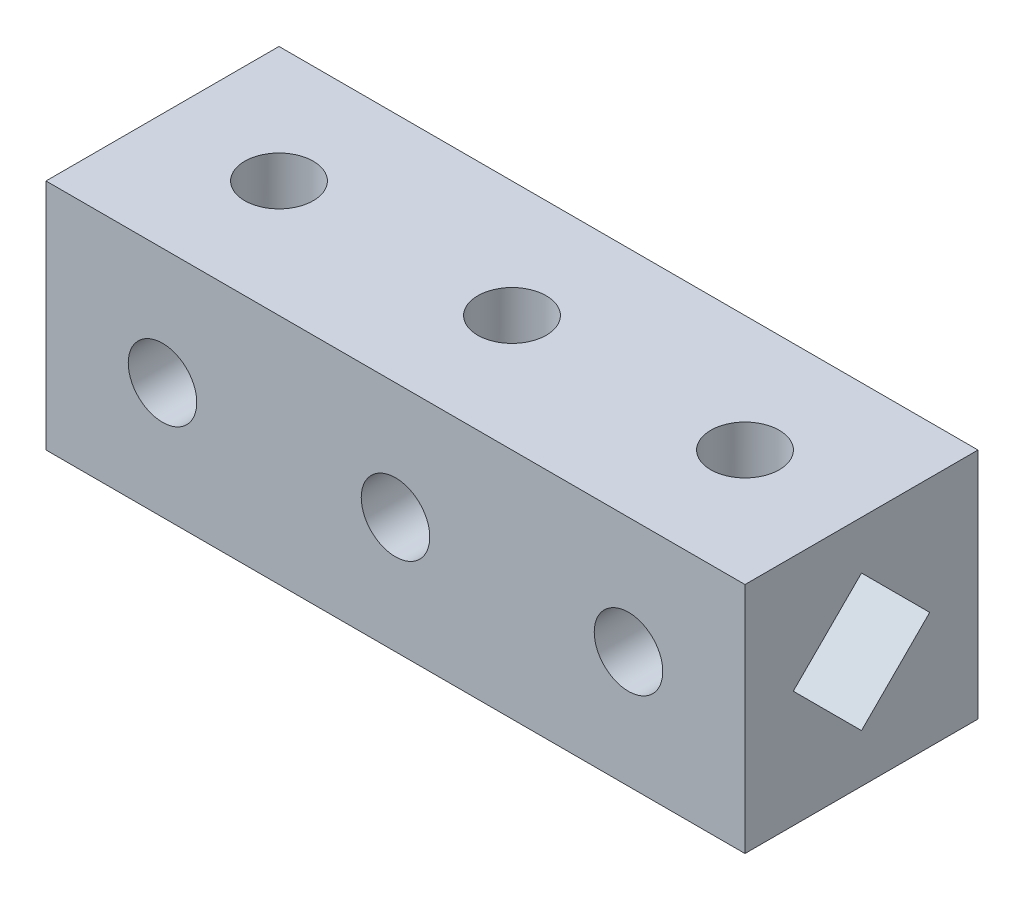
ISO-10303-21;
HEADER;
FILE_DESCRIPTION(('STEP AP214'),'2;1');
FILE_NAME('part.step','',(''),(''),'','','');
FILE_SCHEMA(('AUTOMOTIVE_DESIGN { 1 0 10303 214 1 1 1 1 }'));
ENDSEC;
DATA;
#1=APPLICATION_CONTEXT('core data for automotive mechanical design processes');
#2=APPLICATION_PROTOCOL_DEFINITION('international standard','automotive_design',2000,#1);
#3=PRODUCT_CONTEXT('',#1,'mechanical');
#4=PRODUCT('Part','Part','',(#3));
#5=PRODUCT_RELATED_PRODUCT_CATEGORY('part','',(#4));
#6=PRODUCT_DEFINITION_FORMATION('','',#4);
#7=PRODUCT_DEFINITION_CONTEXT('part definition',#1,'design');
#8=PRODUCT_DEFINITION('design','',#6,#7);
#9=PRODUCT_DEFINITION_SHAPE('','',#8);
#10=(LENGTH_UNIT() NAMED_UNIT(*) SI_UNIT(.MILLI.,.METRE.));
#11=(NAMED_UNIT(*) PLANE_ANGLE_UNIT() SI_UNIT($,.RADIAN.));
#12=(NAMED_UNIT(*) SI_UNIT($,.STERADIAN.) SOLID_ANGLE_UNIT());
#13=UNCERTAINTY_MEASURE_WITH_UNIT(LENGTH_MEASURE(1.E-05),#10,'distance_accuracy_value','');
#14=(GEOMETRIC_REPRESENTATION_CONTEXT(3) GLOBAL_UNCERTAINTY_ASSIGNED_CONTEXT((#13)) GLOBAL_UNIT_ASSIGNED_CONTEXT((#10,
#11,#12)) REPRESENTATION_CONTEXT('',''));
#15=CARTESIAN_POINT('',(0.,0.,0.));
#16=DIRECTION('',(0.,0.,1.));
#17=DIRECTION('',(1.,0.,0.));
#18=AXIS2_PLACEMENT_3D('',#15,#16,#17);
#19=CARTESIAN_POINT('',(8.5,17.,8.5));
#20=DIRECTION('',(0.,-1.,0.));
#21=DIRECTION('',(0.,0.,-1.));
#22=AXIS2_PLACEMENT_3D('',#19,#20,#21);
#23=CYLINDRICAL_SURFACE('',#22,2.5);
#24=CARTESIAN_POINT('',(8.5,13.4780317395533,8.5));
#25=DIRECTION('',(0.,0.707106781186547,0.707106781186547));
#26=DIRECTION('',(0.,-0.707106781186548,0.707106781186548));
#27=AXIS2_PLACEMENT_3D('',#24,#25,#26);
#28=ELLIPSE('',#27,3.53553390593274,2.5);
#29=CARTESIAN_POINT('',(8.73409399821436,10.9890158697767,10.9890158697767));
#30=VERTEX_POINT('',#29);
#31=CARTESIAN_POINT('',(11.,13.4780317395533,8.50000000000001));
#32=VERTEX_POINT('',#31);
#33=EDGE_CURVE('E243',#30,#32,#28,.T.);
#34=ORIENTED_EDGE('',*,*,#33,.F.);
#35=CARTESIAN_POINT('',(8.5,8.5,8.5));
#36=DIRECTION('',(0.,-0.707106781186547,0.707106781186547));
#37=DIRECTION('',(0.,-0.707106781186547,-0.707106781186547));
#38=AXIS2_PLACEMENT_3D('',#35,#36,#37);
#39=ELLIPSE('',#38,3.53553390593274,2.5);
#40=CARTESIAN_POINT('',(8.26590600178563,10.9890158697767,10.9890158697767));
#41=VERTEX_POINT('',#40);
#42=EDGE_CURVE('E433',#41,#30,#39,.F.);
#43=ORIENTED_EDGE('',*,*,#42,.F.);
#44=CARTESIAN_POINT('',(6.,13.4780317395533,8.50000000000001));
#45=VERTEX_POINT('',#44);
#46=EDGE_CURVE('E292',#45,#41,#28,.T.);
#47=ORIENTED_EDGE('',*,*,#46,.F.);
#48=CARTESIAN_POINT('',(8.5,13.4780317395533,8.5));
#49=DIRECTION('',(0.,0.707106781186547,-0.707106781186547));
#50=DIRECTION('',(0.,-0.707106781186548,-0.707106781186548));
#51=AXIS2_PLACEMENT_3D('',#48,#49,#50);
#52=ELLIPSE('',#51,3.53553390593274,2.5);
#53=CARTESIAN_POINT('',(8.26590600178555,10.9890158697766,6.01098413022336));
#54=VERTEX_POINT('',#53);
#55=EDGE_CURVE('E276',#54,#45,#52,.T.);
#56=ORIENTED_EDGE('',*,*,#55,.F.);
#57=CARTESIAN_POINT('',(8.5,8.5,8.5));
#58=DIRECTION('',(0.,-0.707106781186547,-0.707106781186547));
#59=DIRECTION('',(0.,-0.707106781186547,0.707106781186547));
#60=AXIS2_PLACEMENT_3D('',#57,#58,#59);
#61=ELLIPSE('',#60,3.53553390593274,2.5);
#62=CARTESIAN_POINT('',(8.73409399821444,10.9890158697766,6.01098413022336));
#63=VERTEX_POINT('',#62);
#64=EDGE_CURVE('E442',#63,#54,#61,.F.);
#65=ORIENTED_EDGE('',*,*,#64,.F.);
#66=EDGE_CURVE('E284',#32,#63,#52,.T.);
#67=ORIENTED_EDGE('',*,*,#66,.F.);
#68=EDGE_LOOP('',(#34,#43,#47,#56,#65,#67));
#69=FACE_BOUND('',#68,.T.);
#70=CARTESIAN_POINT('',(8.5,17.,8.5));
#71=DIRECTION('',(0.,1.,0.));
#72=DIRECTION('',(0.,0.,1.));
#73=AXIS2_PLACEMENT_3D('',#70,#71,#72);
#74=CIRCLE('',#73,2.5);
#75=CARTESIAN_POINT('',(8.5,17.,11.));
#76=VERTEX_POINT('',#75);
#77=EDGE_CURVE('E375',#76,#76,#74,.T.);
#78=ORIENTED_EDGE('',*,*,#77,.T.);
#79=EDGE_LOOP('',(#78));
#80=FACE_BOUND('',#79,.T.);
#81=ADVANCED_FACE('F42',(#69,#80),#23,.F.);
#82=CARTESIAN_POINT('',(25.5,17.,8.5));
#83=DIRECTION('',(0.,-1.,0.));
#84=DIRECTION('',(0.,0.,-1.));
#85=AXIS2_PLACEMENT_3D('',#82,#83,#84);
#86=CYLINDRICAL_SURFACE('',#85,2.5);
#87=CARTESIAN_POINT('',(25.5,8.5,8.5));
#88=DIRECTION('',(0.,-0.707106781186547,-0.707106781186547));
#89=DIRECTION('',(0.,-0.707106781186547,0.707106781186547));
#90=AXIS2_PLACEMENT_3D('',#87,#88,#89);
#91=ELLIPSE('',#90,3.53553390593274,2.5);
#92=CARTESIAN_POINT('',(28.,8.5,8.5));
#93=VERTEX_POINT('',#92);
#94=CARTESIAN_POINT('',(23.,8.5,8.5));
#95=VERTEX_POINT('',#94);
#96=EDGE_CURVE('E430',#93,#95,#91,.F.);
#97=ORIENTED_EDGE('',*,*,#96,.F.);
#98=CARTESIAN_POINT('',(25.5,8.5,8.5));
#99=DIRECTION('',(0.,-0.707106781186547,0.707106781186547));
#100=DIRECTION('',(0.,-0.707106781186547,-0.707106781186547));
#101=AXIS2_PLACEMENT_3D('',#98,#99,#100);
#102=ELLIPSE('',#101,3.53553390593274,2.5);
#103=EDGE_CURVE('E422',#95,#93,#102,.F.);
#104=ORIENTED_EDGE('',*,*,#103,.F.);
#105=EDGE_LOOP('',(#97,#104));
#106=FACE_BOUND('',#105,.T.);
#107=CARTESIAN_POINT('',(25.5,17.,8.5));
#108=DIRECTION('',(0.,1.,0.));
#109=DIRECTION('',(0.,0.,1.));
#110=AXIS2_PLACEMENT_3D('',#107,#108,#109);
#111=CIRCLE('',#110,2.5);
#112=CARTESIAN_POINT('',(25.5,17.,11.));
#113=VERTEX_POINT('',#112);
#114=EDGE_CURVE('E369',#113,#113,#111,.T.);
#115=ORIENTED_EDGE('',*,*,#114,.T.);
#116=EDGE_LOOP('',(#115));
#117=FACE_BOUND('',#116,.T.);
#118=ADVANCED_FACE('F524',(#106,#117),#86,.F.);
#119=CARTESIAN_POINT('',(42.5,17.,8.5));
#120=DIRECTION('',(0.,-1.,0.));
#121=DIRECTION('',(0.,0.,-1.));
#122=AXIS2_PLACEMENT_3D('',#119,#120,#121);
#123=CYLINDRICAL_SURFACE('',#122,2.5);
#124=CARTESIAN_POINT('',(42.5,13.4780317395533,8.5));
#125=DIRECTION('',(0.,0.707106781186547,0.707106781186547));
#126=DIRECTION('',(0.,-0.707106781186548,0.707106781186548));
#127=AXIS2_PLACEMENT_3D('',#124,#125,#126);
#128=ELLIPSE('',#127,3.53553390593274,2.5);
#129=CARTESIAN_POINT('',(42.7340939982144,10.9890158697766,10.9890158697766));
#130=VERTEX_POINT('',#129);
#131=CARTESIAN_POINT('',(45.,13.4780317395533,8.5));
#132=VERTEX_POINT('',#131);
#133=EDGE_CURVE('E341',#130,#132,#128,.T.);
#134=ORIENTED_EDGE('',*,*,#133,.F.);
#135=CARTESIAN_POINT('',(42.5,8.5,8.5));
#136=DIRECTION('',(0.,-0.707106781186547,0.707106781186547));
#137=DIRECTION('',(0.,-0.707106781186547,-0.707106781186547));
#138=AXIS2_PLACEMENT_3D('',#135,#136,#137);
#139=ELLIPSE('',#138,3.53553390593274,2.5);
#140=CARTESIAN_POINT('',(42.2659060017856,10.9890158697766,10.9890158697766));
#141=VERTEX_POINT('',#140);
#142=EDGE_CURVE('E410',#141,#130,#139,.F.);
#143=ORIENTED_EDGE('',*,*,#142,.F.);
#144=CARTESIAN_POINT('',(40.,13.4780317395533,8.5));
#145=VERTEX_POINT('',#144);
#146=EDGE_CURVE('E343',#145,#141,#128,.T.);
#147=ORIENTED_EDGE('',*,*,#146,.F.);
#148=CARTESIAN_POINT('',(42.5,13.4780317395533,8.5));
#149=DIRECTION('',(0.,0.707106781186547,-0.707106781186548));
#150=DIRECTION('',(0.,-0.707106781186548,-0.707106781186547));
#151=AXIS2_PLACEMENT_3D('',#148,#149,#150);
#152=ELLIPSE('',#151,3.53553390593274,2.5);
#153=CARTESIAN_POINT('',(42.2659060017856,10.9890158697766,6.01098413022336));
#154=VERTEX_POINT('',#153);
#155=EDGE_CURVE('E335',#154,#145,#152,.T.);
#156=ORIENTED_EDGE('',*,*,#155,.F.);
#157=CARTESIAN_POINT('',(42.5,8.5,8.5));
#158=DIRECTION('',(0.,-0.707106781186547,-0.707106781186547));
#159=DIRECTION('',(0.,-0.707106781186547,0.707106781186547));
#160=AXIS2_PLACEMENT_3D('',#157,#158,#159);
#161=ELLIPSE('',#160,3.53553390593274,2.5);
#162=CARTESIAN_POINT('',(42.7340939982144,10.9890158697766,6.01098413022336));
#163=VERTEX_POINT('',#162);
#164=EDGE_CURVE('E419',#163,#154,#161,.F.);
#165=ORIENTED_EDGE('',*,*,#164,.F.);
#166=EDGE_CURVE('E337',#132,#163,#152,.T.);
#167=ORIENTED_EDGE('',*,*,#166,.F.);
#168=EDGE_LOOP('',(#134,#143,#147,#156,#165,#167));
#169=FACE_BOUND('',#168,.T.);
#170=CARTESIAN_POINT('',(42.5,17.,8.5));
#171=DIRECTION('',(0.,1.,0.));
#172=DIRECTION('',(0.,0.,1.));
#173=AXIS2_PLACEMENT_3D('',#170,#171,#172);
#174=CIRCLE('',#173,2.5);
#175=CARTESIAN_POINT('',(42.5,17.,11.));
#176=VERTEX_POINT('',#175);
#177=EDGE_CURVE('E363',#176,#176,#174,.T.);
#178=ORIENTED_EDGE('',*,*,#177,.T.);
#179=EDGE_LOOP('',(#178));
#180=FACE_BOUND('',#179,.T.);
#181=ADVANCED_FACE('F531',(#169,#180),#123,.F.);
#182=CARTESIAN_POINT('',(0.,17.,0.));
#183=DIRECTION('',(0.,1.,0.));
#184=DIRECTION('',(0.,0.,1.));
#185=AXIS2_PLACEMENT_3D('',#182,#183,#184);
#186=PLANE('',#185);
#187=DIRECTION('',(1.,0.,0.));
#188=VECTOR('',#187,1.);
#189=CARTESIAN_POINT('',(0.,17.,17.));
#190=LINE('',#189,#188);
#191=CARTESIAN_POINT('',(0.,17.,17.));
#192=VERTEX_POINT('',#191);
#193=CARTESIAN_POINT('',(51.,17.,17.));
#194=VERTEX_POINT('',#193);
#195=EDGE_CURVE('E384',#192,#194,#190,.T.);
#196=ORIENTED_EDGE('',*,*,#195,.T.);
#197=DIRECTION('',(0.,0.,-1.));
#198=VECTOR('',#197,1.);
#199=CARTESIAN_POINT('',(51.,17.,0.));
#200=LINE('',#199,#198);
#201=CARTESIAN_POINT('',(51.,17.,0.));
#202=VERTEX_POINT('',#201);
#203=EDGE_CURVE('E387',#194,#202,#200,.T.);
#204=ORIENTED_EDGE('',*,*,#203,.T.);
#205=DIRECTION('',(-1.,0.,0.));
#206=VECTOR('',#205,1.);
#207=CARTESIAN_POINT('',(0.,17.,0.));
#208=LINE('',#207,#206);
#209=CARTESIAN_POINT('',(0.,17.,0.));
#210=VERTEX_POINT('',#209);
#211=EDGE_CURVE('E389',#202,#210,#208,.T.);
#212=ORIENTED_EDGE('',*,*,#211,.T.);
#213=DIRECTION('',(0.,0.,1.));
#214=VECTOR('',#213,1.);
#215=CARTESIAN_POINT('',(0.,17.,0.));
#216=LINE('',#215,#214);
#217=EDGE_CURVE('E381',#210,#192,#216,.T.);
#218=ORIENTED_EDGE('',*,*,#217,.T.);
#219=EDGE_LOOP('',(#196,#204,#212,#218));
#220=FACE_BOUND('',#219,.T.);
#221=ORIENTED_EDGE('',*,*,#77,.F.);
#222=EDGE_LOOP('',(#221));
#223=FACE_BOUND('',#222,.T.);
#224=ORIENTED_EDGE('',*,*,#114,.F.);
#225=EDGE_LOOP('',(#224));
#226=FACE_BOUND('',#225,.T.);
#227=ORIENTED_EDGE('',*,*,#177,.F.);
#228=EDGE_LOOP('',(#227));
#229=FACE_BOUND('',#228,.T.);
#230=ADVANCED_FACE('F769',(#220,#223,#226,#229),#186,.T.);
#231=CARTESIAN_POINT('',(0.,0.,0.));
#232=DIRECTION('',(0.,1.,0.));
#233=DIRECTION('',(0.,0.,1.));
#234=AXIS2_PLACEMENT_3D('',#231,#232,#233);
#235=PLANE('',#234);
#236=DIRECTION('',(0.,0.,1.));
#237=VECTOR('',#236,1.);
#238=CARTESIAN_POINT('',(0.,0.,0.));
#239=LINE('',#238,#237);
#240=CARTESIAN_POINT('',(0.,0.,0.));
#241=VERTEX_POINT('',#240);
#242=CARTESIAN_POINT('',(0.,0.,17.));
#243=VERTEX_POINT('',#242);
#244=EDGE_CURVE('E378',#241,#243,#239,.T.);
#245=ORIENTED_EDGE('',*,*,#244,.F.);
#246=DIRECTION('',(-1.,0.,0.));
#247=VECTOR('',#246,1.);
#248=CARTESIAN_POINT('',(0.,0.,0.));
#249=LINE('',#248,#247);
#250=CARTESIAN_POINT('',(51.,0.,0.));
#251=VERTEX_POINT('',#250);
#252=EDGE_CURVE('E385',#251,#241,#249,.T.);
#253=ORIENTED_EDGE('',*,*,#252,.F.);
#254=DIRECTION('',(0.,0.,-1.));
#255=VECTOR('',#254,1.);
#256=CARTESIAN_POINT('',(51.,0.,0.));
#257=LINE('',#256,#255);
#258=CARTESIAN_POINT('',(51.,0.,17.));
#259=VERTEX_POINT('',#258);
#260=EDGE_CURVE('E396',#259,#251,#257,.T.);
#261=ORIENTED_EDGE('',*,*,#260,.F.);
#262=DIRECTION('',(1.,0.,0.));
#263=VECTOR('',#262,1.);
#264=CARTESIAN_POINT('',(0.,0.,17.));
#265=LINE('',#264,#263);
#266=EDGE_CURVE('E394',#243,#259,#265,.T.);
#267=ORIENTED_EDGE('',*,*,#266,.F.);
#268=EDGE_LOOP('',(#245,#253,#261,#267));
#269=FACE_BOUND('',#268,.T.);
#270=CARTESIAN_POINT('',(8.5,0.,8.5));
#271=DIRECTION('',(0.,1.,0.));
#272=DIRECTION('',(0.,0.,1.));
#273=AXIS2_PLACEMENT_3D('',#270,#271,#272);
#274=CIRCLE('',#273,2.5);
#275=CARTESIAN_POINT('',(8.5,0.,11.));
#276=VERTEX_POINT('',#275);
#277=EDGE_CURVE('E372',#276,#276,#274,.T.);
#278=ORIENTED_EDGE('',*,*,#277,.T.);
#279=EDGE_LOOP('',(#278));
#280=FACE_BOUND('',#279,.T.);
#281=CARTESIAN_POINT('',(25.5,0.,8.5));
#282=DIRECTION('',(0.,1.,0.));
#283=DIRECTION('',(0.,0.,1.));
#284=AXIS2_PLACEMENT_3D('',#281,#282,#283);
#285=CIRCLE('',#284,2.5);
#286=CARTESIAN_POINT('',(25.5,0.,11.));
#287=VERTEX_POINT('',#286);
#288=EDGE_CURVE('E366',#287,#287,#285,.T.);
#289=ORIENTED_EDGE('',*,*,#288,.T.);
#290=EDGE_LOOP('',(#289));
#291=FACE_BOUND('',#290,.T.);
#292=CARTESIAN_POINT('',(42.5,0.,8.5));
#293=DIRECTION('',(0.,1.,0.));
#294=DIRECTION('',(0.,0.,1.));
#295=AXIS2_PLACEMENT_3D('',#292,#293,#294);
#296=CIRCLE('',#295,2.5);
#297=CARTESIAN_POINT('',(42.5,0.,11.));
#298=VERTEX_POINT('',#297);
#299=EDGE_CURVE('E360',#298,#298,#296,.T.);
#300=ORIENTED_EDGE('',*,*,#299,.T.);
#301=EDGE_LOOP('',(#300));
#302=FACE_BOUND('',#301,.T.);
#303=ADVANCED_FACE('F558',(#269,#280,#291,#302),#235,.F.);
#304=CARTESIAN_POINT('',(0.,17.,0.));
#305=DIRECTION('',(1.,0.,0.));
#306=DIRECTION('',(0.,0.,-1.));
#307=AXIS2_PLACEMENT_3D('',#304,#305,#306);
#308=PLANE('',#307);
#309=DIRECTION('',(0.,-0.707106781186548,-0.707106781186548));
#310=VECTOR('',#309,1.);
#311=CARTESIAN_POINT('',(0.,13.4780317395533,8.50000000000001));
#312=LINE('',#311,#310);
#313=CARTESIAN_POINT('',(0.,13.4780317395533,8.50000000000001));
#314=VERTEX_POINT('',#313);
#315=CARTESIAN_POINT('',(0.,8.5,3.52196826044672));
#316=VERTEX_POINT('',#315);
#317=EDGE_CURVE('E270',#314,#316,#312,.T.);
#318=ORIENTED_EDGE('',*,*,#317,.F.);
#319=DIRECTION('',(0.,0.707106781186548,-0.707106781186548));
#320=VECTOR('',#319,1.);
#321=CARTESIAN_POINT('',(0.,8.5,13.4780317395533));
#322=LINE('',#321,#320);
#323=CARTESIAN_POINT('',(0.,8.5,13.4780317395533));
#324=VERTEX_POINT('',#323);
#325=EDGE_CURVE('E58',#324,#314,#322,.T.);
#326=ORIENTED_EDGE('',*,*,#325,.F.);
#327=DIRECTION('',(0.,0.707106781186547,0.707106781186548));
#328=VECTOR('',#327,1.);
#329=CARTESIAN_POINT('',(0.,3.52196826044671,8.50000000000001));
#330=LINE('',#329,#328);
#331=CARTESIAN_POINT('',(0.,3.52196826044671,8.50000000000001));
#332=VERTEX_POINT('',#331);
#333=EDGE_CURVE('E261',#332,#324,#330,.T.);
#334=ORIENTED_EDGE('',*,*,#333,.F.);
#335=DIRECTION('',(0.,-0.707106781186548,0.707106781186547));
#336=VECTOR('',#335,1.);
#337=CARTESIAN_POINT('',(0.,8.5,3.52196826044672));
#338=LINE('',#337,#336);
#339=EDGE_CURVE('E264',#316,#332,#338,.T.);
#340=ORIENTED_EDGE('',*,*,#339,.F.);
#341=EDGE_LOOP('',(#318,#326,#334,#340));
#342=FACE_BOUND('',#341,.T.);
#343=ORIENTED_EDGE('',*,*,#244,.T.);
#344=DIRECTION('',(0.,-1.,0.));
#345=VECTOR('',#344,1.);
#346=CARTESIAN_POINT('',(0.,17.,17.));
#347=LINE('',#346,#345);
#348=EDGE_CURVE('E407',#192,#243,#347,.T.);
#349=ORIENTED_EDGE('',*,*,#348,.F.);
#350=ORIENTED_EDGE('',*,*,#217,.F.);
#351=DIRECTION('',(0.,-1.,0.));
#352=VECTOR('',#351,1.);
#353=CARTESIAN_POINT('',(0.,17.,0.));
#354=LINE('',#353,#352);
#355=EDGE_CURVE('E391',#210,#241,#354,.T.);
#356=ORIENTED_EDGE('',*,*,#355,.T.);
#357=EDGE_LOOP('',(#343,#349,#350,#356));
#358=FACE_BOUND('',#357,.T.);
#359=ADVANCED_FACE('F44',(#342,#358),#308,.F.);
#360=CARTESIAN_POINT('',(0.,17.,17.));
#361=DIRECTION('',(0.,0.,-1.));
#362=DIRECTION('',(-1.,0.,0.));
#363=AXIS2_PLACEMENT_3D('',#360,#361,#362);
#364=PLANE('',#363);
#365=ORIENTED_EDGE('',*,*,#266,.T.);
#366=DIRECTION('',(0.,-1.,0.));
#367=VECTOR('',#366,1.);
#368=CARTESIAN_POINT('',(51.,17.,17.));
#369=LINE('',#368,#367);
#370=EDGE_CURVE('E404',#194,#259,#369,.T.);
#371=ORIENTED_EDGE('',*,*,#370,.F.);
#372=ORIENTED_EDGE('',*,*,#195,.F.);
#373=ORIENTED_EDGE('',*,*,#348,.T.);
#374=EDGE_LOOP('',(#365,#371,#372,#373));
#375=FACE_BOUND('',#374,.T.);
#376=CARTESIAN_POINT('',(8.49999999999999,8.5,17.));
#377=DIRECTION('',(0.,0.,-1.));
#378=DIRECTION('',(-1.,0.,0.));
#379=AXIS2_PLACEMENT_3D('',#376,#377,#378);
#380=CIRCLE('',#379,2.5);
#381=CARTESIAN_POINT('',(5.99999999999999,8.5,17.));
#382=VERTEX_POINT('',#381);
#383=EDGE_CURVE('E348',#382,#382,#380,.T.);
#384=ORIENTED_EDGE('',*,*,#383,.T.);
#385=EDGE_LOOP('',(#384));
#386=FACE_BOUND('',#385,.T.);
#387=CARTESIAN_POINT('',(25.5,8.5,17.));
#388=DIRECTION('',(0.,0.,-1.));
#389=DIRECTION('',(-1.,0.,0.));
#390=AXIS2_PLACEMENT_3D('',#387,#388,#389);
#391=CIRCLE('',#390,2.5);
#392=CARTESIAN_POINT('',(23.,8.5,17.));
#393=VERTEX_POINT('',#392);
#394=EDGE_CURVE('E354',#393,#393,#391,.T.);
#395=ORIENTED_EDGE('',*,*,#394,.T.);
#396=EDGE_LOOP('',(#395));
#397=FACE_BOUND('',#396,.T.);
#398=CARTESIAN_POINT('',(42.5,8.5,17.));
#399=DIRECTION('',(0.,0.,-1.));
#400=DIRECTION('',(-1.,0.,0.));
#401=AXIS2_PLACEMENT_3D('',#398,#399,#400);
#402=CIRCLE('',#401,2.5);
#403=CARTESIAN_POINT('',(40.,8.5,17.));
#404=VERTEX_POINT('',#403);
#405=EDGE_CURVE('E357',#404,#404,#402,.T.);
#406=ORIENTED_EDGE('',*,*,#405,.T.);
#407=EDGE_LOOP('',(#406));
#408=FACE_BOUND('',#407,.T.);
#409=ADVANCED_FACE('F552',(#375,#386,#397,#408),#364,.F.);
#410=CARTESIAN_POINT('',(51.,17.,0.));
#411=DIRECTION('',(-1.,0.,0.));
#412=DIRECTION('',(0.,0.,1.));
#413=AXIS2_PLACEMENT_3D('',#410,#411,#412);
#414=PLANE('',#413);
#415=DIRECTION('',(0.,-0.707106781186547,-0.707106781186548));
#416=VECTOR('',#415,1.);
#417=CARTESIAN_POINT('',(51.,3.52196826044671,8.5));
#418=LINE('',#417,#416);
#419=CARTESIAN_POINT('',(51.,8.5,13.4780317395533));
#420=VERTEX_POINT('',#419);
#421=CARTESIAN_POINT('',(51.,3.52196826044671,8.5));
#422=VERTEX_POINT('',#421);
#423=EDGE_CURVE('E309',#420,#422,#418,.T.);
#424=ORIENTED_EDGE('',*,*,#423,.F.);
#425=DIRECTION('',(0.,-0.707106781186548,0.707106781186548));
#426=VECTOR('',#425,1.);
#427=CARTESIAN_POINT('',(51.,8.5,13.4780317395533));
#428=LINE('',#427,#426);
#429=CARTESIAN_POINT('',(51.,13.4780317395533,8.5));
#430=VERTEX_POINT('',#429);
#431=EDGE_CURVE('E307',#430,#420,#428,.T.);
#432=ORIENTED_EDGE('',*,*,#431,.F.);
#433=DIRECTION('',(0.,0.707106781186548,0.707106781186547));
#434=VECTOR('',#433,1.);
#435=CARTESIAN_POINT('',(51.,13.4780317395533,8.5));
#436=LINE('',#435,#434);
#437=CARTESIAN_POINT('',(51.,8.5,3.52196826044671));
#438=VERTEX_POINT('',#437);
#439=EDGE_CURVE('E297',#438,#430,#436,.T.);
#440=ORIENTED_EDGE('',*,*,#439,.F.);
#441=DIRECTION('',(0.,0.707106781186548,-0.707106781186547));
#442=VECTOR('',#441,1.);
#443=CARTESIAN_POINT('',(51.,8.5,3.52196826044671));
#444=LINE('',#443,#442);
#445=EDGE_CURVE('E312',#422,#438,#444,.T.);
#446=ORIENTED_EDGE('',*,*,#445,.F.);
#447=EDGE_LOOP('',(#424,#432,#440,#446));
#448=FACE_BOUND('',#447,.T.);
#449=ORIENTED_EDGE('',*,*,#260,.T.);
#450=DIRECTION('',(0.,-1.,0.));
#451=VECTOR('',#450,1.);
#452=CARTESIAN_POINT('',(51.,17.,0.));
#453=LINE('',#452,#451);
#454=EDGE_CURVE('E401',#202,#251,#453,.T.);
#455=ORIENTED_EDGE('',*,*,#454,.F.);
#456=ORIENTED_EDGE('',*,*,#203,.F.);
#457=ORIENTED_EDGE('',*,*,#370,.T.);
#458=EDGE_LOOP('',(#449,#455,#456,#457));
#459=FACE_BOUND('',#458,.T.);
#460=ADVANCED_FACE('F545',(#448,#459),#414,.F.);
#461=CARTESIAN_POINT('',(0.,17.,0.));
#462=DIRECTION('',(0.,0.,1.));
#463=DIRECTION('',(1.,0.,0.));
#464=AXIS2_PLACEMENT_3D('',#461,#462,#463);
#465=PLANE('',#464);
#466=ORIENTED_EDGE('',*,*,#355,.F.);
#467=ORIENTED_EDGE('',*,*,#211,.F.);
#468=ORIENTED_EDGE('',*,*,#454,.T.);
#469=ORIENTED_EDGE('',*,*,#252,.T.);
#470=EDGE_LOOP('',(#466,#467,#468,#469));
#471=FACE_BOUND('',#470,.T.);
#472=CARTESIAN_POINT('',(8.49999999999999,8.5,0.));
#473=DIRECTION('',(0.,0.,-1.));
#474=DIRECTION('',(-1.,0.,0.));
#475=AXIS2_PLACEMENT_3D('',#472,#473,#474);
#476=CIRCLE('',#475,2.5);
#477=CARTESIAN_POINT('',(5.99999999999999,8.5,0.));
#478=VERTEX_POINT('',#477);
#479=EDGE_CURVE('E344',#478,#478,#476,.T.);
#480=ORIENTED_EDGE('',*,*,#479,.F.);
#481=EDGE_LOOP('',(#480));
#482=FACE_BOUND('',#481,.T.);
#483=CARTESIAN_POINT('',(25.5,8.5,0.));
#484=DIRECTION('',(0.,0.,-1.));
#485=DIRECTION('',(-1.,0.,0.));
#486=AXIS2_PLACEMENT_3D('',#483,#484,#485);
#487=CIRCLE('',#486,2.5);
#488=CARTESIAN_POINT('',(23.,8.5,0.));
#489=VERTEX_POINT('',#488);
#490=EDGE_CURVE('E351',#489,#489,#487,.T.);
#491=ORIENTED_EDGE('',*,*,#490,.F.);
#492=EDGE_LOOP('',(#491));
#493=FACE_BOUND('',#492,.T.);
#494=CARTESIAN_POINT('',(42.5,8.5,0.));
#495=DIRECTION('',(0.,0.,-1.));
#496=DIRECTION('',(-1.,0.,0.));
#497=AXIS2_PLACEMENT_3D('',#494,#495,#496);
#498=CIRCLE('',#497,2.5);
#499=CARTESIAN_POINT('',(40.,8.5,0.));
#500=VERTEX_POINT('',#499);
#501=EDGE_CURVE('E347',#500,#500,#498,.T.);
#502=ORIENTED_EDGE('',*,*,#501,.F.);
#503=EDGE_LOOP('',(#502));
#504=FACE_BOUND('',#503,.T.);
#505=ADVANCED_FACE('F537',(#471,#482,#493,#504),#465,.F.);
#506=CARTESIAN_POINT('',(8.5,3.5219682604467,8.5));
#507=DIRECTION('',(0.,-0.707106781186548,0.707106781186547));
#508=DIRECTION('',(0.,-0.707106781186547,-0.707106781186548));
#509=AXIS2_PLACEMENT_3D('',#506,#507,#508);
#510=ELLIPSE('',#509,3.53553390593274,2.5);
#511=CARTESIAN_POINT('',(8.26590600178562,6.01098413022335,10.9890158697767));
#512=VERTEX_POINT('',#511);
#513=CARTESIAN_POINT('',(6.,3.52196826044671,8.50000000000001));
#514=VERTEX_POINT('',#513);
#515=EDGE_CURVE('E288',#512,#514,#510,.T.);
#516=ORIENTED_EDGE('',*,*,#515,.F.);
#517=CARTESIAN_POINT('',(8.5,8.5,8.5));
#518=DIRECTION('',(0.,-0.707106781186547,-0.707106781186547));
#519=DIRECTION('',(0.,-0.707106781186547,0.707106781186547));
#520=AXIS2_PLACEMENT_3D('',#517,#518,#519);
#521=ELLIPSE('',#520,3.53553390593274,2.5);
#522=CARTESIAN_POINT('',(8.73409399821437,6.01098413022335,10.9890158697767));
#523=VERTEX_POINT('',#522);
#524=EDGE_CURVE('E439',#523,#512,#521,.T.);
#525=ORIENTED_EDGE('',*,*,#524,.F.);
#526=CARTESIAN_POINT('',(11.,3.52196826044671,8.5));
#527=VERTEX_POINT('',#526);
#528=EDGE_CURVE('E290',#527,#523,#510,.T.);
#529=ORIENTED_EDGE('',*,*,#528,.F.);
#530=CARTESIAN_POINT('',(8.5,3.52196826044671,8.5));
#531=DIRECTION('',(0.,-0.707106781186547,-0.707106781186548));
#532=DIRECTION('',(0.,-0.707106781186548,0.707106781186547));
#533=AXIS2_PLACEMENT_3D('',#530,#531,#532);
#534=ELLIPSE('',#533,3.53553390593274,2.5);
#535=CARTESIAN_POINT('',(8.73409399821444,6.01098413022336,6.01098413022336));
#536=VERTEX_POINT('',#535);
#537=EDGE_CURVE('E285',#536,#527,#534,.T.);
#538=ORIENTED_EDGE('',*,*,#537,.F.);
#539=CARTESIAN_POINT('',(8.5,8.5,8.5));
#540=DIRECTION('',(0.,-0.707106781186547,0.707106781186547));
#541=DIRECTION('',(0.,-0.707106781186547,-0.707106781186547));
#542=AXIS2_PLACEMENT_3D('',#539,#540,#541);
#543=ELLIPSE('',#542,3.53553390593274,2.5);
#544=CARTESIAN_POINT('',(8.26590600178555,6.01098413022336,6.01098413022336));
#545=VERTEX_POINT('',#544);
#546=EDGE_CURVE('E436',#545,#536,#543,.T.);
#547=ORIENTED_EDGE('',*,*,#546,.F.);
#548=EDGE_CURVE('E287',#514,#545,#534,.T.);
#549=ORIENTED_EDGE('',*,*,#548,.F.);
#550=EDGE_LOOP('',(#516,#525,#529,#538,#547,#549));
#551=FACE_BOUND('',#550,.T.);
#552=ORIENTED_EDGE('',*,*,#277,.F.);
#553=EDGE_LOOP('',(#552));
#554=FACE_BOUND('',#553,.T.);
#555=ADVANCED_FACE('F481',(#551,#554),#23,.F.);
#556=CARTESIAN_POINT('',(25.5,8.5,8.5));
#557=DIRECTION('',(0.,-0.707106781186547,-0.707106781186547));
#558=DIRECTION('',(0.,-0.707106781186547,0.707106781186547));
#559=AXIS2_PLACEMENT_3D('',#556,#557,#558);
#560=ELLIPSE('',#559,3.53553390593274,2.5);
#561=EDGE_CURVE('E427',#93,#95,#560,.T.);
#562=ORIENTED_EDGE('',*,*,#561,.F.);
#563=CARTESIAN_POINT('',(25.5,8.5,8.5));
#564=DIRECTION('',(0.,-0.707106781186547,0.707106781186547));
#565=DIRECTION('',(0.,-0.707106781186547,-0.707106781186547));
#566=AXIS2_PLACEMENT_3D('',#563,#564,#565);
#567=ELLIPSE('',#566,3.53553390593274,2.5);
#568=EDGE_CURVE('E425',#95,#93,#567,.T.);
#569=ORIENTED_EDGE('',*,*,#568,.F.);
#570=EDGE_LOOP('',(#562,#569));
#571=FACE_BOUND('',#570,.T.);
#572=ORIENTED_EDGE('',*,*,#288,.F.);
#573=EDGE_LOOP('',(#572));
#574=FACE_BOUND('',#573,.T.);
#575=ADVANCED_FACE('F534',(#571,#574),#86,.F.);
#576=CARTESIAN_POINT('',(42.5,3.52196826044671,8.5));
#577=DIRECTION('',(0.,-0.707106781186547,-0.707106781186548));
#578=DIRECTION('',(0.,-0.707106781186548,0.707106781186547));
#579=AXIS2_PLACEMENT_3D('',#576,#577,#578);
#580=ELLIPSE('',#579,3.53553390593274,2.5);
#581=CARTESIAN_POINT('',(42.7340939982144,6.01098413022335,6.01098413022335));
#582=VERTEX_POINT('',#581);
#583=CARTESIAN_POINT('',(45.,3.52196826044671,8.5));
#584=VERTEX_POINT('',#583);
#585=EDGE_CURVE('E320',#582,#584,#580,.T.);
#586=ORIENTED_EDGE('',*,*,#585,.F.);
#587=CARTESIAN_POINT('',(42.5,8.5,8.5));
#588=DIRECTION('',(0.,-0.707106781186547,0.707106781186547));
#589=DIRECTION('',(0.,-0.707106781186547,-0.707106781186547));
#590=AXIS2_PLACEMENT_3D('',#587,#588,#589);
#591=ELLIPSE('',#590,3.53553390593274,2.5);
#592=CARTESIAN_POINT('',(42.2659060017856,6.01098413022335,6.01098413022335));
#593=VERTEX_POINT('',#592);
#594=EDGE_CURVE('E413',#593,#582,#591,.T.);
#595=ORIENTED_EDGE('',*,*,#594,.F.);
#596=CARTESIAN_POINT('',(40.,3.52196826044671,8.5));
#597=VERTEX_POINT('',#596);
#598=EDGE_CURVE('E334',#597,#593,#580,.T.);
#599=ORIENTED_EDGE('',*,*,#598,.F.);
#600=CARTESIAN_POINT('',(42.5,3.52196826044671,8.5));
#601=DIRECTION('',(0.,-0.707106781186548,0.707106781186547));
#602=DIRECTION('',(0.,-0.707106781186547,-0.707106781186548));
#603=AXIS2_PLACEMENT_3D('',#600,#601,#602);
#604=ELLIPSE('',#603,3.53553390593274,2.5);
#605=CARTESIAN_POINT('',(42.2659060017856,6.01098413022335,10.9890158697766));
#606=VERTEX_POINT('',#605);
#607=EDGE_CURVE('E338',#606,#597,#604,.T.);
#608=ORIENTED_EDGE('',*,*,#607,.F.);
#609=CARTESIAN_POINT('',(42.5,8.5,8.5));
#610=DIRECTION('',(0.,-0.707106781186547,-0.707106781186547));
#611=DIRECTION('',(0.,-0.707106781186547,0.707106781186547));
#612=AXIS2_PLACEMENT_3D('',#609,#610,#611);
#613=ELLIPSE('',#612,3.53553390593274,2.5);
#614=CARTESIAN_POINT('',(42.7340939982144,6.01098413022335,10.9890158697766));
#615=VERTEX_POINT('',#614);
#616=EDGE_CURVE('E416',#615,#606,#613,.T.);
#617=ORIENTED_EDGE('',*,*,#616,.F.);
#618=EDGE_CURVE('E340',#584,#615,#604,.T.);
#619=ORIENTED_EDGE('',*,*,#618,.F.);
#620=EDGE_LOOP('',(#586,#595,#599,#608,#617,#619));
#621=FACE_BOUND('',#620,.T.);
#622=ORIENTED_EDGE('',*,*,#299,.F.);
#623=EDGE_LOOP('',(#622));
#624=FACE_BOUND('',#623,.T.);
#625=ADVANCED_FACE('F543',(#621,#624),#123,.F.);
#626=CARTESIAN_POINT('',(42.5,8.5,17.));
#627=DIRECTION('',(0.,0.,-1.));
#628=DIRECTION('',(-1.,0.,0.));
#629=AXIS2_PLACEMENT_3D('',#626,#627,#628);
#630=CYLINDRICAL_SURFACE('',#629,2.5);
#631=ORIENTED_EDGE('',*,*,#142,.T.);
#632=CARTESIAN_POINT('',(42.5,8.5,13.4780317395533));
#633=DIRECTION('',(0.,0.707106781186547,0.707106781186547));
#634=DIRECTION('',(0.,0.707106781186548,-0.707106781186548));
#635=AXIS2_PLACEMENT_3D('',#632,#633,#634);
#636=ELLIPSE('',#635,3.53553390593274,2.5);
#637=CARTESIAN_POINT('',(45.,8.5,13.4780317395533));
#638=VERTEX_POINT('',#637);
#639=EDGE_CURVE('E460',#130,#638,#636,.F.);
#640=ORIENTED_EDGE('',*,*,#639,.T.);
#641=CARTESIAN_POINT('',(42.5,8.5,13.4780317395533));
#642=DIRECTION('',(0.,-0.707106781186548,0.707106781186547));
#643=DIRECTION('',(0.,-0.707106781186547,-0.707106781186548));
#644=AXIS2_PLACEMENT_3D('',#641,#642,#643);
#645=ELLIPSE('',#644,3.53553390593274,2.5);
#646=EDGE_CURVE('E457',#638,#615,#645,.F.);
#647=ORIENTED_EDGE('',*,*,#646,.T.);
#648=ORIENTED_EDGE('',*,*,#616,.T.);
#649=CARTESIAN_POINT('',(40.,8.5,13.4780317395533));
#650=VERTEX_POINT('',#649);
#651=EDGE_CURVE('E453',#606,#650,#645,.F.);
#652=ORIENTED_EDGE('',*,*,#651,.T.);
#653=EDGE_CURVE('E456',#650,#141,#636,.F.);
#654=ORIENTED_EDGE('',*,*,#653,.T.);
#655=EDGE_LOOP('',(#631,#640,#647,#648,#652,#654));
#656=FACE_BOUND('',#655,.T.);
#657=ORIENTED_EDGE('',*,*,#405,.F.);
#658=EDGE_LOOP('',(#657));
#659=FACE_BOUND('',#658,.T.);
#660=ADVANCED_FACE('F571',(#656,#659),#630,.F.);
#661=ORIENTED_EDGE('',*,*,#164,.T.);
#662=CARTESIAN_POINT('',(42.5,8.5,3.52196826044671));
#663=DIRECTION('',(0.,0.707106781186547,-0.707106781186548));
#664=DIRECTION('',(0.,-0.707106781186548,-0.707106781186547));
#665=AXIS2_PLACEMENT_3D('',#662,#663,#664);
#666=ELLIPSE('',#665,3.53553390593274,2.5);
#667=CARTESIAN_POINT('',(40.,8.5,3.52196826044671));
#668=VERTEX_POINT('',#667);
#669=EDGE_CURVE('E452',#154,#668,#666,.F.);
#670=ORIENTED_EDGE('',*,*,#669,.T.);
#671=CARTESIAN_POINT('',(42.5,8.5,3.52196826044671));
#672=DIRECTION('',(0.,-0.707106781186547,-0.707106781186548));
#673=DIRECTION('',(0.,0.707106781186548,-0.707106781186547));
#674=AXIS2_PLACEMENT_3D('',#671,#672,#673);
#675=ELLIPSE('',#674,3.53553390593274,2.5);
#676=EDGE_CURVE('E449',#668,#593,#675,.F.);
#677=ORIENTED_EDGE('',*,*,#676,.T.);
#678=ORIENTED_EDGE('',*,*,#594,.T.);
#679=CARTESIAN_POINT('',(45.,8.5,3.52196826044671));
#680=VERTEX_POINT('',#679);
#681=EDGE_CURVE('E445',#582,#680,#675,.F.);
#682=ORIENTED_EDGE('',*,*,#681,.T.);
#683=EDGE_CURVE('E448',#680,#163,#666,.F.);
#684=ORIENTED_EDGE('',*,*,#683,.T.);
#685=EDGE_LOOP('',(#661,#670,#677,#678,#682,#684));
#686=FACE_BOUND('',#685,.T.);
#687=ORIENTED_EDGE('',*,*,#501,.T.);
#688=EDGE_LOOP('',(#687));
#689=FACE_BOUND('',#688,.T.);
#690=ADVANCED_FACE('F573',(#686,#689),#630,.F.);
#691=CARTESIAN_POINT('',(25.5,8.5,17.));
#692=DIRECTION('',(0.,0.,-1.));
#693=DIRECTION('',(-1.,0.,0.));
#694=AXIS2_PLACEMENT_3D('',#691,#692,#693);
#695=CYLINDRICAL_SURFACE('',#694,2.5);
#696=ORIENTED_EDGE('',*,*,#561,.T.);
#697=ORIENTED_EDGE('',*,*,#103,.T.);
#698=EDGE_LOOP('',(#696,#697));
#699=FACE_BOUND('',#698,.T.);
#700=ORIENTED_EDGE('',*,*,#394,.F.);
#701=EDGE_LOOP('',(#700));
#702=FACE_BOUND('',#701,.T.);
#703=ADVANCED_FACE('F580',(#699,#702),#695,.F.);
#704=ORIENTED_EDGE('',*,*,#96,.T.);
#705=ORIENTED_EDGE('',*,*,#568,.T.);
#706=EDGE_LOOP('',(#704,#705));
#707=FACE_BOUND('',#706,.T.);
#708=ORIENTED_EDGE('',*,*,#490,.T.);
#709=EDGE_LOOP('',(#708));
#710=FACE_BOUND('',#709,.T.);
#711=ADVANCED_FACE('F585',(#707,#710),#695,.F.);
#712=CARTESIAN_POINT('',(8.49999999999999,8.5,17.));
#713=DIRECTION('',(0.,0.,-1.));
#714=DIRECTION('',(-1.,0.,0.));
#715=AXIS2_PLACEMENT_3D('',#712,#713,#714);
#716=CYLINDRICAL_SURFACE('',#715,2.5);
#717=ORIENTED_EDGE('',*,*,#42,.T.);
#718=CARTESIAN_POINT('',(8.49999999999999,8.5,13.4780317395533));
#719=DIRECTION('',(0.,0.707106781186547,0.707106781186547));
#720=DIRECTION('',(0.,0.707106781186548,-0.707106781186548));
#721=AXIS2_PLACEMENT_3D('',#718,#719,#720);
#722=ELLIPSE('',#721,3.53553390593274,2.5);
#723=CARTESIAN_POINT('',(11.,8.5,13.4780317395533));
#724=VERTEX_POINT('',#723);
#725=EDGE_CURVE('E12',#30,#724,#722,.F.);
#726=ORIENTED_EDGE('',*,*,#725,.T.);
#727=CARTESIAN_POINT('',(8.49999999999999,8.5,13.4780317395533));
#728=DIRECTION('',(0.,-0.707106781186548,0.707106781186547));
#729=DIRECTION('',(0.,-0.707106781186547,-0.707106781186548));
#730=AXIS2_PLACEMENT_3D('',#727,#728,#729);
#731=ELLIPSE('',#730,3.53553390593274,2.5);
#732=EDGE_CURVE('E51',#724,#523,#731,.F.);
#733=ORIENTED_EDGE('',*,*,#732,.T.);
#734=ORIENTED_EDGE('',*,*,#524,.T.);
#735=CARTESIAN_POINT('',(5.99999999999999,8.5,13.4780317395533));
#736=VERTEX_POINT('',#735);
#737=EDGE_CURVE('E468',#512,#736,#731,.F.);
#738=ORIENTED_EDGE('',*,*,#737,.T.);
#739=EDGE_CURVE('E46',#736,#41,#722,.F.);
#740=ORIENTED_EDGE('',*,*,#739,.T.);
#741=EDGE_LOOP('',(#717,#726,#733,#734,#738,#740));
#742=FACE_BOUND('',#741,.T.);
#743=ORIENTED_EDGE('',*,*,#383,.F.);
#744=EDGE_LOOP('',(#743));
#745=FACE_BOUND('',#744,.T.);
#746=ADVANCED_FACE('F475',(#742,#745),#716,.F.);
#747=ORIENTED_EDGE('',*,*,#546,.T.);
#748=CARTESIAN_POINT('',(8.49999999999999,8.5,3.52196826044672));
#749=DIRECTION('',(0.,-0.707106781186547,-0.707106781186548));
#750=DIRECTION('',(0.,0.707106781186548,-0.707106781186547));
#751=AXIS2_PLACEMENT_3D('',#748,#749,#750);
#752=ELLIPSE('',#751,3.53553390593274,2.5);
#753=CARTESIAN_POINT('',(11.,8.5,3.52196826044671));
#754=VERTEX_POINT('',#753);
#755=EDGE_CURVE('E467',#536,#754,#752,.F.);
#756=ORIENTED_EDGE('',*,*,#755,.T.);
#757=CARTESIAN_POINT('',(8.49999999999999,8.5,3.52196826044671));
#758=DIRECTION('',(0.,0.707106781186547,-0.707106781186547));
#759=DIRECTION('',(0.,-0.707106781186548,-0.707106781186548));
#760=AXIS2_PLACEMENT_3D('',#757,#758,#759);
#761=ELLIPSE('',#760,3.53553390593274,2.5);
#762=EDGE_CURVE('E465',#754,#63,#761,.F.);
#763=ORIENTED_EDGE('',*,*,#762,.T.);
#764=ORIENTED_EDGE('',*,*,#64,.T.);
#765=CARTESIAN_POINT('',(5.99999999999999,8.5,3.52196826044671));
#766=VERTEX_POINT('',#765);
#767=EDGE_CURVE('E461',#54,#766,#761,.F.);
#768=ORIENTED_EDGE('',*,*,#767,.T.);
#769=EDGE_CURVE('E464',#766,#545,#752,.F.);
#770=ORIENTED_EDGE('',*,*,#769,.T.);
#771=EDGE_LOOP('',(#747,#756,#763,#764,#768,#770));
#772=FACE_BOUND('',#771,.T.);
#773=ORIENTED_EDGE('',*,*,#479,.T.);
#774=EDGE_LOOP('',(#773));
#775=FACE_BOUND('',#774,.T.);
#776=ADVANCED_FACE('F506',(#772,#775),#716,.F.);
#777=CARTESIAN_POINT('',(34.,8.5,3.52196826044671));
#778=DIRECTION('',(0.,-0.707106781186547,-0.707106781186548));
#779=DIRECTION('',(0.,0.707106781186548,-0.707106781186547));
#780=AXIS2_PLACEMENT_3D('',#777,#778,#779);
#781=PLANE('',#780);
#782=ORIENTED_EDGE('',*,*,#585,.T.);
#783=DIRECTION('',(1.,0.,0.));
#784=VECTOR('',#783,1.);
#785=CARTESIAN_POINT('',(34.,3.52196826044671,8.5));
#786=LINE('',#785,#784);
#787=EDGE_CURVE('E329',#584,#422,#786,.T.);
#788=ORIENTED_EDGE('',*,*,#787,.T.);
#789=ORIENTED_EDGE('',*,*,#445,.T.);
#790=DIRECTION('',(1.,0.,0.));
#791=VECTOR('',#790,1.);
#792=CARTESIAN_POINT('',(34.,8.5,3.52196826044671));
#793=LINE('',#792,#791);
#794=EDGE_CURVE('E325',#680,#438,#793,.T.);
#795=ORIENTED_EDGE('',*,*,#794,.F.);
#796=ORIENTED_EDGE('',*,*,#681,.F.);
#797=EDGE_LOOP('',(#782,#788,#789,#795,#796));
#798=FACE_BOUND('',#797,.T.);
#799=ADVANCED_FACE('F591',(#798),#781,.F.);
#800=CARTESIAN_POINT('',(34.,13.4780317395533,8.5));
#801=DIRECTION('',(0.,0.707106781186547,-0.707106781186548));
#802=DIRECTION('',(0.,0.707106781186548,0.707106781186547));
#803=AXIS2_PLACEMENT_3D('',#800,#801,#802);
#804=PLANE('',#803);
#805=ORIENTED_EDGE('',*,*,#166,.T.);
#806=ORIENTED_EDGE('',*,*,#683,.F.);
#807=ORIENTED_EDGE('',*,*,#794,.T.);
#808=ORIENTED_EDGE('',*,*,#439,.T.);
#809=DIRECTION('',(1.,0.,0.));
#810=VECTOR('',#809,1.);
#811=CARTESIAN_POINT('',(34.,13.4780317395533,8.5));
#812=LINE('',#811,#810);
#813=EDGE_CURVE('E321',#132,#430,#812,.T.);
#814=ORIENTED_EDGE('',*,*,#813,.F.);
#815=EDGE_LOOP('',(#805,#806,#807,#808,#814));
#816=FACE_BOUND('',#815,.T.);
#817=ADVANCED_FACE('F606',(#816),#804,.F.);
#818=CARTESIAN_POINT('',(34.,3.52196826044671,8.5));
#819=DIRECTION('',(0.,-0.707106781186548,0.707106781186547));
#820=DIRECTION('',(0.,-0.707106781186547,-0.707106781186548));
#821=AXIS2_PLACEMENT_3D('',#818,#819,#820);
#822=PLANE('',#821);
#823=ORIENTED_EDGE('',*,*,#618,.T.);
#824=ORIENTED_EDGE('',*,*,#646,.F.);
#825=DIRECTION('',(1.,0.,0.));
#826=VECTOR('',#825,1.);
#827=CARTESIAN_POINT('',(34.,8.5,13.4780317395533));
#828=LINE('',#827,#826);
#829=EDGE_CURVE('E306',#638,#420,#828,.T.);
#830=ORIENTED_EDGE('',*,*,#829,.T.);
#831=ORIENTED_EDGE('',*,*,#423,.T.);
#832=ORIENTED_EDGE('',*,*,#787,.F.);
#833=EDGE_LOOP('',(#823,#824,#830,#831,#832));
#834=FACE_BOUND('',#833,.T.);
#835=ADVANCED_FACE('F596',(#834),#822,.F.);
#836=CARTESIAN_POINT('',(34.,8.5,13.4780317395533));
#837=DIRECTION('',(0.,0.707106781186547,0.707106781186547));
#838=DIRECTION('',(0.,-0.707106781186548,0.707106781186548));
#839=AXIS2_PLACEMENT_3D('',#836,#837,#838);
#840=PLANE('',#839);
#841=ORIENTED_EDGE('',*,*,#133,.T.);
#842=ORIENTED_EDGE('',*,*,#813,.T.);
#843=ORIENTED_EDGE('',*,*,#431,.T.);
#844=ORIENTED_EDGE('',*,*,#829,.F.);
#845=ORIENTED_EDGE('',*,*,#639,.F.);
#846=EDGE_LOOP('',(#841,#842,#843,#844,#845));
#847=FACE_BOUND('',#846,.T.);
#848=ADVANCED_FACE('F592',(#847),#840,.F.);
#849=ORIENTED_EDGE('',*,*,#146,.T.);
#850=ORIENTED_EDGE('',*,*,#653,.F.);
#851=CARTESIAN_POINT('',(34.,8.5,13.4780317395533));
#852=VERTEX_POINT('',#851);
#853=EDGE_CURVE('E330',#852,#650,#828,.T.);
#854=ORIENTED_EDGE('',*,*,#853,.F.);
#855=DIRECTION('',(0.,-0.707106781186548,0.707106781186548));
#856=VECTOR('',#855,1.);
#857=CARTESIAN_POINT('',(34.,8.5,13.4780317395533));
#858=LINE('',#857,#856);
#859=CARTESIAN_POINT('',(34.,13.4780317395533,8.5));
#860=VERTEX_POINT('',#859);
#861=EDGE_CURVE('E293',#860,#852,#858,.T.);
#862=ORIENTED_EDGE('',*,*,#861,.F.);
#863=EDGE_CURVE('E317',#860,#145,#812,.T.);
#864=ORIENTED_EDGE('',*,*,#863,.T.);
#865=EDGE_LOOP('',(#849,#850,#854,#862,#864));
#866=FACE_BOUND('',#865,.T.);
#867=ADVANCED_FACE('F595',(#866),#840,.F.);
#868=ORIENTED_EDGE('',*,*,#598,.T.);
#869=ORIENTED_EDGE('',*,*,#676,.F.);
#870=CARTESIAN_POINT('',(34.,8.5,3.52196826044671));
#871=VERTEX_POINT('',#870);
#872=EDGE_CURVE('E322',#871,#668,#793,.T.);
#873=ORIENTED_EDGE('',*,*,#872,.F.);
#874=DIRECTION('',(0.,0.707106781186548,-0.707106781186547));
#875=VECTOR('',#874,1.);
#876=CARTESIAN_POINT('',(34.,8.5,3.52196826044671));
#877=LINE('',#876,#875);
#878=CARTESIAN_POINT('',(34.,3.52196826044671,8.5));
#879=VERTEX_POINT('',#878);
#880=EDGE_CURVE('E300',#879,#871,#877,.T.);
#881=ORIENTED_EDGE('',*,*,#880,.F.);
#882=EDGE_CURVE('E326',#879,#597,#786,.T.);
#883=ORIENTED_EDGE('',*,*,#882,.T.);
#884=EDGE_LOOP('',(#868,#869,#873,#881,#883));
#885=FACE_BOUND('',#884,.T.);
#886=ADVANCED_FACE('F608',(#885),#781,.F.);
#887=ORIENTED_EDGE('',*,*,#155,.T.);
#888=ORIENTED_EDGE('',*,*,#863,.F.);
#889=DIRECTION('',(0.,0.707106781186548,0.707106781186547));
#890=VECTOR('',#889,1.);
#891=CARTESIAN_POINT('',(34.,13.4780317395533,8.5));
#892=LINE('',#891,#890);
#893=EDGE_CURVE('E303',#871,#860,#892,.T.);
#894=ORIENTED_EDGE('',*,*,#893,.F.);
#895=ORIENTED_EDGE('',*,*,#872,.T.);
#896=ORIENTED_EDGE('',*,*,#669,.F.);
#897=EDGE_LOOP('',(#887,#888,#894,#895,#896));
#898=FACE_BOUND('',#897,.T.);
#899=ADVANCED_FACE('F602',(#898),#804,.F.);
#900=ORIENTED_EDGE('',*,*,#607,.T.);
#901=ORIENTED_EDGE('',*,*,#882,.F.);
#902=DIRECTION('',(0.,-0.707106781186547,-0.707106781186548));
#903=VECTOR('',#902,1.);
#904=CARTESIAN_POINT('',(34.,3.52196826044671,8.5));
#905=LINE('',#904,#903);
#906=EDGE_CURVE('E296',#852,#879,#905,.T.);
#907=ORIENTED_EDGE('',*,*,#906,.F.);
#908=ORIENTED_EDGE('',*,*,#853,.T.);
#909=ORIENTED_EDGE('',*,*,#651,.F.);
#910=EDGE_LOOP('',(#900,#901,#907,#908,#909));
#911=FACE_BOUND('',#910,.T.);
#912=ADVANCED_FACE('F598',(#911),#822,.F.);
#913=CARTESIAN_POINT('',(34.,0.,0.));
#914=DIRECTION('',(-1.,0.,0.));
#915=DIRECTION('',(0.,0.,1.));
#916=AXIS2_PLACEMENT_3D('',#913,#914,#915);
#917=PLANE('',#916);
#918=ORIENTED_EDGE('',*,*,#861,.T.);
#919=ORIENTED_EDGE('',*,*,#906,.T.);
#920=ORIENTED_EDGE('',*,*,#880,.T.);
#921=ORIENTED_EDGE('',*,*,#893,.T.);
#922=EDGE_LOOP('',(#918,#919,#920,#921));
#923=FACE_BOUND('',#922,.T.);
#924=ADVANCED_FACE('F601',(#923),#917,.F.);
#925=CARTESIAN_POINT('',(17.,13.4780317395533,8.50000000000001));
#926=DIRECTION('',(0.,0.707106781186547,-0.707106781186547));
#927=DIRECTION('',(0.,0.707106781186548,0.707106781186548));
#928=AXIS2_PLACEMENT_3D('',#925,#926,#927);
#929=PLANE('',#928);
#930=ORIENTED_EDGE('',*,*,#55,.T.);
#931=DIRECTION('',(-1.,0.,0.));
#932=VECTOR('',#931,1.);
#933=CARTESIAN_POINT('',(17.,13.4780317395533,8.50000000000001));
#934=LINE('',#933,#932);
#935=EDGE_CURVE('E246',#45,#314,#934,.T.);
#936=ORIENTED_EDGE('',*,*,#935,.T.);
#937=ORIENTED_EDGE('',*,*,#317,.T.);
#938=DIRECTION('',(-1.,0.,0.));
#939=VECTOR('',#938,1.);
#940=CARTESIAN_POINT('',(17.,8.5,3.52196826044671));
#941=LINE('',#940,#939);
#942=EDGE_CURVE('E66',#766,#316,#941,.T.);
#943=ORIENTED_EDGE('',*,*,#942,.F.);
#944=ORIENTED_EDGE('',*,*,#767,.F.);
#945=EDGE_LOOP('',(#930,#936,#937,#943,#944));
#946=FACE_BOUND('',#945,.T.);
#947=ADVANCED_FACE('F518',(#946),#929,.F.);
#948=CARTESIAN_POINT('',(17.,8.5,3.52196826044671));
#949=DIRECTION('',(0.,-0.707106781186547,-0.707106781186548));
#950=DIRECTION('',(0.,0.707106781186548,-0.707106781186547));
#951=AXIS2_PLACEMENT_3D('',#948,#949,#950);
#952=PLANE('',#951);
#953=ORIENTED_EDGE('',*,*,#548,.T.);
#954=ORIENTED_EDGE('',*,*,#769,.F.);
#955=ORIENTED_EDGE('',*,*,#942,.T.);
#956=ORIENTED_EDGE('',*,*,#339,.T.);
#957=DIRECTION('',(-1.,0.,0.));
#958=VECTOR('',#957,1.);
#959=CARTESIAN_POINT('',(17.,3.52196826044671,8.5));
#960=LINE('',#959,#958);
#961=EDGE_CURVE('E281',#514,#332,#960,.T.);
#962=ORIENTED_EDGE('',*,*,#961,.F.);
#963=EDGE_LOOP('',(#953,#954,#955,#956,#962));
#964=FACE_BOUND('',#963,.T.);
#965=ADVANCED_FACE('F491',(#964),#952,.F.);
#966=CARTESIAN_POINT('',(17.,3.52196826044671,8.5));
#967=DIRECTION('',(0.,-0.707106781186548,0.707106781186547));
#968=DIRECTION('',(0.,-0.707106781186547,-0.707106781186548));
#969=AXIS2_PLACEMENT_3D('',#966,#967,#968);
#970=PLANE('',#969);
#971=ORIENTED_EDGE('',*,*,#515,.T.);
#972=ORIENTED_EDGE('',*,*,#961,.T.);
#973=ORIENTED_EDGE('',*,*,#333,.T.);
#974=DIRECTION('',(-1.,0.,0.));
#975=VECTOR('',#974,1.);
#976=CARTESIAN_POINT('',(17.,8.5,13.4780317395533));
#977=LINE('',#976,#975);
#978=EDGE_CURVE('E277',#736,#324,#977,.T.);
#979=ORIENTED_EDGE('',*,*,#978,.F.);
#980=ORIENTED_EDGE('',*,*,#737,.F.);
#981=EDGE_LOOP('',(#971,#972,#973,#979,#980));
#982=FACE_BOUND('',#981,.T.);
#983=ADVANCED_FACE('F488',(#982),#970,.F.);
#984=CARTESIAN_POINT('',(17.,8.5,13.4780317395533));
#985=DIRECTION('',(0.,0.707106781186547,0.707106781186547));
#986=DIRECTION('',(0.,-0.707106781186548,0.707106781186548));
#987=AXIS2_PLACEMENT_3D('',#984,#985,#986);
#988=PLANE('',#987);
#989=ORIENTED_EDGE('',*,*,#46,.T.);
#990=ORIENTED_EDGE('',*,*,#739,.F.);
#991=ORIENTED_EDGE('',*,*,#978,.T.);
#992=ORIENTED_EDGE('',*,*,#325,.T.);
#993=ORIENTED_EDGE('',*,*,#935,.F.);
#994=EDGE_LOOP('',(#989,#990,#991,#992,#993));
#995=FACE_BOUND('',#994,.T.);
#996=ADVANCED_FACE('F497',(#995),#988,.F.);
#997=ORIENTED_EDGE('',*,*,#528,.T.);
#998=ORIENTED_EDGE('',*,*,#732,.F.);
#999=CARTESIAN_POINT('',(17.,8.5,13.4780317395533));
#1000=VERTEX_POINT('',#999);
#1001=EDGE_CURVE('E274',#1000,#724,#977,.T.);
#1002=ORIENTED_EDGE('',*,*,#1001,.F.);
#1003=DIRECTION('',(0.,0.707106781186547,0.707106781186548));
#1004=VECTOR('',#1003,1.);
#1005=CARTESIAN_POINT('',(17.,3.52196826044671,8.5));
#1006=LINE('',#1005,#1004);
#1007=CARTESIAN_POINT('',(17.,3.52196826044671,8.5));
#1008=VERTEX_POINT('',#1007);
#1009=EDGE_CURVE('E260',#1008,#1000,#1006,.T.);
#1010=ORIENTED_EDGE('',*,*,#1009,.F.);
#1011=EDGE_CURVE('E278',#1008,#527,#960,.T.);
#1012=ORIENTED_EDGE('',*,*,#1011,.T.);
#1013=EDGE_LOOP('',(#997,#998,#1002,#1010,#1012));
#1014=FACE_BOUND('',#1013,.T.);
#1015=ADVANCED_FACE('F510',(#1014),#970,.F.);
#1016=ORIENTED_EDGE('',*,*,#66,.T.);
#1017=ORIENTED_EDGE('',*,*,#762,.F.);
#1018=CARTESIAN_POINT('',(17.,8.5,3.52196826044671));
#1019=VERTEX_POINT('',#1018);
#1020=EDGE_CURVE('E252',#1019,#754,#941,.T.);
#1021=ORIENTED_EDGE('',*,*,#1020,.F.);
#1022=DIRECTION('',(0.,-0.707106781186548,-0.707106781186548));
#1023=VECTOR('',#1022,1.);
#1024=CARTESIAN_POINT('',(17.,13.4780317395533,8.50000000000001));
#1025=LINE('',#1024,#1023);
#1026=CARTESIAN_POINT('',(17.,13.4780317395533,8.50000000000001));
#1027=VERTEX_POINT('',#1026);
#1028=EDGE_CURVE('E249',#1027,#1019,#1025,.T.);
#1029=ORIENTED_EDGE('',*,*,#1028,.F.);
#1030=EDGE_CURVE('E235',#1027,#32,#934,.T.);
#1031=ORIENTED_EDGE('',*,*,#1030,.T.);
#1032=EDGE_LOOP('',(#1016,#1017,#1021,#1029,#1031));
#1033=FACE_BOUND('',#1032,.T.);
#1034=ADVANCED_FACE('F250',(#1033),#929,.F.);
#1035=ORIENTED_EDGE('',*,*,#33,.T.);
#1036=ORIENTED_EDGE('',*,*,#1030,.F.);
#1037=DIRECTION('',(0.,0.707106781186548,-0.707106781186548));
#1038=VECTOR('',#1037,1.);
#1039=CARTESIAN_POINT('',(17.,8.5,13.4780317395533));
#1040=LINE('',#1039,#1038);
#1041=EDGE_CURVE('E240',#1000,#1027,#1040,.T.);
#1042=ORIENTED_EDGE('',*,*,#1041,.F.);
#1043=ORIENTED_EDGE('',*,*,#1001,.T.);
#1044=ORIENTED_EDGE('',*,*,#725,.F.);
#1045=EDGE_LOOP('',(#1035,#1036,#1042,#1043,#1044));
#1046=FACE_BOUND('',#1045,.T.);
#1047=ADVANCED_FACE('F237',(#1046),#988,.F.);
#1048=ORIENTED_EDGE('',*,*,#537,.T.);
#1049=ORIENTED_EDGE('',*,*,#1011,.F.);
#1050=DIRECTION('',(0.,-0.707106781186548,0.707106781186547));
#1051=VECTOR('',#1050,1.);
#1052=CARTESIAN_POINT('',(17.,8.5,3.52196826044671));
#1053=LINE('',#1052,#1051);
#1054=EDGE_CURVE('E256',#1019,#1008,#1053,.T.);
#1055=ORIENTED_EDGE('',*,*,#1054,.F.);
#1056=ORIENTED_EDGE('',*,*,#1020,.T.);
#1057=ORIENTED_EDGE('',*,*,#755,.F.);
#1058=EDGE_LOOP('',(#1048,#1049,#1055,#1056,#1057));
#1059=FACE_BOUND('',#1058,.T.);
#1060=ADVANCED_FACE('F509',(#1059),#952,.F.);
#1061=CARTESIAN_POINT('',(17.,0.,0.));
#1062=DIRECTION('',(-1.,0.,0.));
#1063=DIRECTION('',(0.,0.,1.));
#1064=AXIS2_PLACEMENT_3D('',#1061,#1062,#1063);
#1065=PLANE('',#1064);
#1066=ORIENTED_EDGE('',*,*,#1041,.T.);
#1067=ORIENTED_EDGE('',*,*,#1028,.T.);
#1068=ORIENTED_EDGE('',*,*,#1054,.T.);
#1069=ORIENTED_EDGE('',*,*,#1009,.T.);
#1070=EDGE_LOOP('',(#1066,#1067,#1068,#1069));
#1071=FACE_BOUND('',#1070,.T.);
#1072=ADVANCED_FACE('F258',(#1071),#1065,.T.);
#1073=CLOSED_SHELL('',(#81,#118,#181,#230,#303,#359,#409,#460,#505,#555,#575,#625,#660,#690,
#703,#711,#746,#776,#799,#817,#835,#848,#867,#886,#899,#912,#924,#947,#965,#983,#996,#1015,
#1034,#1047,#1060,#1072));
#1074=MANIFOLD_SOLID_BREP('B2',#1073);
#1075=ADVANCED_BREP_SHAPE_REPRESENTATION('',(#18,#1074),#14);
#1076=SHAPE_DEFINITION_REPRESENTATION(#9,#1075);
ENDSEC;
END-ISO-10303-21;
